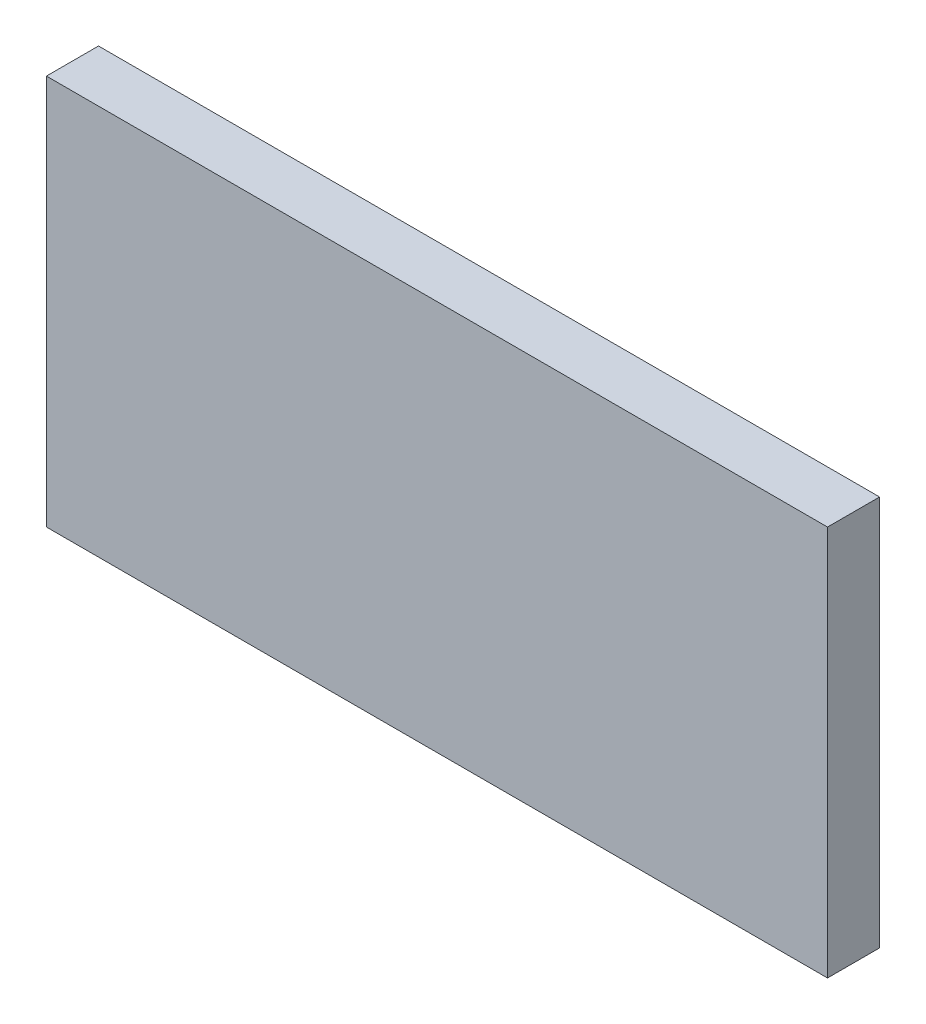
ISO-10303-21;
HEADER;
FILE_DESCRIPTION(('STEP AP214'),'2;1');
FILE_NAME('part.step','',(''),(''),'','','');
FILE_SCHEMA(('AUTOMOTIVE_DESIGN { 1 0 10303 214 1 1 1 1 }'));
ENDSEC;
DATA;
#1=APPLICATION_CONTEXT('core data for automotive mechanical design processes');
#2=APPLICATION_PROTOCOL_DEFINITION('international standard','automotive_design',2000,#1);
#3=PRODUCT_CONTEXT('',#1,'mechanical');
#4=PRODUCT('Part','Part','',(#3));
#5=PRODUCT_RELATED_PRODUCT_CATEGORY('part','',(#4));
#6=PRODUCT_DEFINITION_FORMATION('','',#4);
#7=PRODUCT_DEFINITION_CONTEXT('part definition',#1,'design');
#8=PRODUCT_DEFINITION('design','',#6,#7);
#9=PRODUCT_DEFINITION_SHAPE('','',#8);
#10=(LENGTH_UNIT() NAMED_UNIT(*) SI_UNIT(.MILLI.,.METRE.));
#11=(NAMED_UNIT(*) PLANE_ANGLE_UNIT() SI_UNIT($,.RADIAN.));
#12=(NAMED_UNIT(*) SI_UNIT($,.STERADIAN.) SOLID_ANGLE_UNIT());
#13=UNCERTAINTY_MEASURE_WITH_UNIT(LENGTH_MEASURE(1.E-05),#10,'distance_accuracy_value','');
#14=(GEOMETRIC_REPRESENTATION_CONTEXT(3) GLOBAL_UNCERTAINTY_ASSIGNED_CONTEXT((#13)) GLOBAL_UNIT_ASSIGNED_CONTEXT((#10,
#11,#12)) REPRESENTATION_CONTEXT('',''));
#15=CARTESIAN_POINT('',(0.,0.,0.));
#16=DIRECTION('',(0.,0.,1.));
#17=DIRECTION('',(1.,0.,0.));
#18=AXIS2_PLACEMENT_3D('',#15,#16,#17);
#19=CARTESIAN_POINT('',(-150.,-75.,20.));
#20=DIRECTION('',(1.,0.,0.));
#21=DIRECTION('',(0.,0.,-1.));
#22=AXIS2_PLACEMENT_3D('',#19,#20,#21);
#23=PLANE('',#22);
#24=DIRECTION('',(0.,-1.,0.));
#25=VECTOR('',#24,1.);
#26=CARTESIAN_POINT('',(-150.,-75.,0.));
#27=LINE('',#26,#25);
#28=CARTESIAN_POINT('',(-150.,75.,0.));
#29=VERTEX_POINT('',#28);
#30=CARTESIAN_POINT('',(-150.,-75.,0.));
#31=VERTEX_POINT('',#30);
#32=EDGE_CURVE('E188',#29,#31,#27,.T.);
#33=ORIENTED_EDGE('',*,*,#32,.T.);
#34=DIRECTION('',(0.,0.,-1.));
#35=VECTOR('',#34,1.);
#36=CARTESIAN_POINT('',(-150.,-75.,20.));
#37=LINE('',#36,#35);
#38=CARTESIAN_POINT('',(-150.,-75.,20.));
#39=VERTEX_POINT('',#38);
#40=EDGE_CURVE('E11',#39,#31,#37,.T.);
#41=ORIENTED_EDGE('',*,*,#40,.F.);
#42=DIRECTION('',(0.,-1.,0.));
#43=VECTOR('',#42,1.);
#44=CARTESIAN_POINT('',(-150.,-75.,20.));
#45=LINE('',#44,#43);
#46=CARTESIAN_POINT('',(-150.,75.,20.));
#47=VERTEX_POINT('',#46);
#48=EDGE_CURVE('E195',#47,#39,#45,.T.);
#49=ORIENTED_EDGE('',*,*,#48,.F.);
#50=DIRECTION('',(0.,0.,-1.));
#51=VECTOR('',#50,1.);
#52=CARTESIAN_POINT('',(-150.,75.,20.));
#53=LINE('',#52,#51);
#54=EDGE_CURVE('E205',#47,#29,#53,.T.);
#55=ORIENTED_EDGE('',*,*,#54,.T.);
#56=EDGE_LOOP('',(#33,#41,#49,#55));
#57=FACE_BOUND('',#56,.T.);
#58=ADVANCED_FACE('F36',(#57),#23,.F.);
#59=CARTESIAN_POINT('',(150.,-75.,20.));
#60=DIRECTION('',(0.,1.,0.));
#61=DIRECTION('',(-1.,0.,0.));
#62=AXIS2_PLACEMENT_3D('',#59,#60,#61);
#63=PLANE('',#62);
#64=DIRECTION('',(1.,0.,0.));
#65=VECTOR('',#64,1.);
#66=CARTESIAN_POINT('',(150.,-75.,0.));
#67=LINE('',#66,#65);
#68=CARTESIAN_POINT('',(150.,-75.,0.));
#69=VERTEX_POINT('',#68);
#70=EDGE_CURVE('E208',#31,#69,#67,.T.);
#71=ORIENTED_EDGE('',*,*,#70,.T.);
#72=DIRECTION('',(0.,0.,-1.));
#73=VECTOR('',#72,1.);
#74=CARTESIAN_POINT('',(150.,-75.,20.));
#75=LINE('',#74,#73);
#76=CARTESIAN_POINT('',(150.,-75.,20.));
#77=VERTEX_POINT('',#76);
#78=EDGE_CURVE('E43',#77,#69,#75,.T.);
#79=ORIENTED_EDGE('',*,*,#78,.F.);
#80=DIRECTION('',(1.,0.,0.));
#81=VECTOR('',#80,1.);
#82=CARTESIAN_POINT('',(150.,-75.,20.));
#83=LINE('',#82,#81);
#84=EDGE_CURVE('E198',#39,#77,#83,.T.);
#85=ORIENTED_EDGE('',*,*,#84,.F.);
#86=ORIENTED_EDGE('',*,*,#40,.T.);
#87=EDGE_LOOP('',(#71,#79,#85,#86));
#88=FACE_BOUND('',#87,.T.);
#89=ADVANCED_FACE('F238',(#88),#63,.F.);
#90=CARTESIAN_POINT('',(150.,-75.,20.));
#91=DIRECTION('',(-1.,0.,0.));
#92=DIRECTION('',(0.,0.,1.));
#93=AXIS2_PLACEMENT_3D('',#90,#91,#92);
#94=PLANE('',#93);
#95=DIRECTION('',(0.,1.,0.));
#96=VECTOR('',#95,1.);
#97=CARTESIAN_POINT('',(150.,-75.,0.));
#98=LINE('',#97,#96);
#99=CARTESIAN_POINT('',(150.,75.,0.));
#100=VERTEX_POINT('',#99);
#101=EDGE_CURVE('E210',#69,#100,#98,.T.);
#102=ORIENTED_EDGE('',*,*,#101,.T.);
#103=DIRECTION('',(0.,0.,-1.));
#104=VECTOR('',#103,1.);
#105=CARTESIAN_POINT('',(150.,75.,20.));
#106=LINE('',#105,#104);
#107=CARTESIAN_POINT('',(150.,75.,20.));
#108=VERTEX_POINT('',#107);
#109=EDGE_CURVE('E215',#108,#100,#106,.T.);
#110=ORIENTED_EDGE('',*,*,#109,.F.);
#111=DIRECTION('',(0.,1.,0.));
#112=VECTOR('',#111,1.);
#113=CARTESIAN_POINT('',(150.,-75.,20.));
#114=LINE('',#113,#112);
#115=EDGE_CURVE('E201',#77,#108,#114,.T.);
#116=ORIENTED_EDGE('',*,*,#115,.F.);
#117=ORIENTED_EDGE('',*,*,#78,.T.);
#118=EDGE_LOOP('',(#102,#110,#116,#117));
#119=FACE_BOUND('',#118,.T.);
#120=ADVANCED_FACE('F222',(#119),#94,.F.);
#121=CARTESIAN_POINT('',(150.,75.,20.));
#122=DIRECTION('',(0.,-1.,0.));
#123=DIRECTION('',(1.,0.,0.));
#124=AXIS2_PLACEMENT_3D('',#121,#122,#123);
#125=PLANE('',#124);
#126=DIRECTION('',(-1.,0.,0.));
#127=VECTOR('',#126,1.);
#128=CARTESIAN_POINT('',(150.,75.,0.));
#129=LINE('',#128,#127);
#130=EDGE_CURVE('E199',#100,#29,#129,.T.);
#131=ORIENTED_EDGE('',*,*,#130,.T.);
#132=ORIENTED_EDGE('',*,*,#54,.F.);
#133=DIRECTION('',(-1.,0.,0.));
#134=VECTOR('',#133,1.);
#135=CARTESIAN_POINT('',(150.,75.,20.));
#136=LINE('',#135,#134);
#137=EDGE_CURVE('E203',#108,#47,#136,.T.);
#138=ORIENTED_EDGE('',*,*,#137,.F.);
#139=ORIENTED_EDGE('',*,*,#109,.T.);
#140=EDGE_LOOP('',(#131,#132,#138,#139));
#141=FACE_BOUND('',#140,.T.);
#142=ADVANCED_FACE('F231',(#141),#125,.F.);
#143=CARTESIAN_POINT('',(0.,0.,20.));
#144=DIRECTION('',(0.,0.,1.));
#145=DIRECTION('',(1.,0.,0.));
#146=AXIS2_PLACEMENT_3D('',#143,#144,#145);
#147=PLANE('',#146);
#148=ORIENTED_EDGE('',*,*,#48,.T.);
#149=ORIENTED_EDGE('',*,*,#84,.T.);
#150=ORIENTED_EDGE('',*,*,#115,.T.);
#151=ORIENTED_EDGE('',*,*,#137,.T.);
#152=EDGE_LOOP('',(#148,#149,#150,#151));
#153=FACE_BOUND('',#152,.T.);
#154=ADVANCED_FACE('F237',(#153),#147,.T.);
#155=CARTESIAN_POINT('',(0.,0.,0.));
#156=DIRECTION('',(0.,0.,1.));
#157=DIRECTION('',(1.,0.,0.));
#158=AXIS2_PLACEMENT_3D('',#155,#156,#157);
#159=PLANE('',#158);
#160=DIRECTION('',(0.,1.,0.));
#161=VECTOR('',#160,1.);
#162=CARTESIAN_POINT('',(56.38,10.,0.));
#163=LINE('',#162,#161);
#164=CARTESIAN_POINT('',(56.38,10.,0.));
#165=VERTEX_POINT('',#164);
#166=CARTESIAN_POINT('',(56.38,30.,0.));
#167=VERTEX_POINT('',#166);
#168=EDGE_CURVE('E50',#165,#167,#163,.T.);
#169=ORIENTED_EDGE('',*,*,#168,.F.);
#170=DIRECTION('',(1.,0.,0.));
#171=VECTOR('',#170,1.);
#172=CARTESIAN_POINT('',(96.3800000000001,10.,0.));
#173=LINE('',#172,#171);
#174=CARTESIAN_POINT('',(96.3800000000001,10.,0.));
#175=VERTEX_POINT('',#174);
#176=EDGE_CURVE('E54',#165,#175,#173,.T.);
#177=ORIENTED_EDGE('',*,*,#176,.T.);
#178=DIRECTION('',(0.,1.,0.));
#179=VECTOR('',#178,1.);
#180=CARTESIAN_POINT('',(96.3800000000001,10.,0.));
#181=LINE('',#180,#179);
#182=CARTESIAN_POINT('',(96.3800000000001,30.,0.));
#183=VERTEX_POINT('',#182);
#184=EDGE_CURVE('E134',#175,#183,#181,.T.);
#185=ORIENTED_EDGE('',*,*,#184,.T.);
#186=DIRECTION('',(1.,0.,0.));
#187=VECTOR('',#186,1.);
#188=CARTESIAN_POINT('',(96.3800000000001,30.,0.));
#189=LINE('',#188,#187);
#190=EDGE_CURVE('E150',#167,#183,#189,.T.);
#191=ORIENTED_EDGE('',*,*,#190,.F.);
#192=EDGE_LOOP('',(#169,#177,#185,#191));
#193=FACE_BOUND('',#192,.T.);
#194=DIRECTION('',(-1.,0.,0.));
#195=VECTOR('',#194,1.);
#196=CARTESIAN_POINT('',(-90.25,-15.,0.));
#197=LINE('',#196,#195);
#198=CARTESIAN_POINT('',(-9.99999999999995,-15.,0.));
#199=VERTEX_POINT('',#198);
#200=CARTESIAN_POINT('',(-90.25,-15.,0.));
#201=VERTEX_POINT('',#200);
#202=EDGE_CURVE('E178',#199,#201,#197,.T.);
#203=ORIENTED_EDGE('',*,*,#202,.F.);
#204=DIRECTION('',(0.,-1.,0.));
#205=VECTOR('',#204,1.);
#206=CARTESIAN_POINT('',(-9.99999999999995,-15.,0.));
#207=LINE('',#206,#205);
#208=CARTESIAN_POINT('',(-9.99999999999996,15.,0.));
#209=VERTEX_POINT('',#208);
#210=EDGE_CURVE('E160',#209,#199,#207,.T.);
#211=ORIENTED_EDGE('',*,*,#210,.F.);
#212=DIRECTION('',(1.,0.,0.));
#213=VECTOR('',#212,1.);
#214=CARTESIAN_POINT('',(-90.25,15.,0.));
#215=LINE('',#214,#213);
#216=CARTESIAN_POINT('',(-90.25,15.,0.));
#217=VERTEX_POINT('',#216);
#218=EDGE_CURVE('E167',#217,#209,#215,.T.);
#219=ORIENTED_EDGE('',*,*,#218,.F.);
#220=DIRECTION('',(0.,1.,0.));
#221=VECTOR('',#220,1.);
#222=CARTESIAN_POINT('',(-90.25,-15.,0.));
#223=LINE('',#222,#221);
#224=EDGE_CURVE('E181',#201,#217,#223,.T.);
#225=ORIENTED_EDGE('',*,*,#224,.F.);
#226=EDGE_LOOP('',(#203,#211,#219,#225));
#227=FACE_BOUND('',#226,.T.);
#228=ORIENTED_EDGE('',*,*,#32,.F.);
#229=ORIENTED_EDGE('',*,*,#130,.F.);
#230=ORIENTED_EDGE('',*,*,#101,.F.);
#231=ORIENTED_EDGE('',*,*,#70,.F.);
#232=EDGE_LOOP('',(#228,#229,#230,#231));
#233=FACE_BOUND('',#232,.T.);
#234=ADVANCED_FACE('F228',(#193,#227,#233),#159,.F.);
#235=CARTESIAN_POINT('',(-9.99999999999995,-15.,15.));
#236=DIRECTION('',(1.,0.,0.));
#237=DIRECTION('',(0.,1.,0.));
#238=AXIS2_PLACEMENT_3D('',#235,#236,#237);
#239=PLANE('',#238);
#240=ORIENTED_EDGE('',*,*,#210,.T.);
#241=DIRECTION('',(0.,0.,-1.));
#242=VECTOR('',#241,1.);
#243=CARTESIAN_POINT('',(-9.99999999999995,-15.,15.));
#244=LINE('',#243,#242);
#245=CARTESIAN_POINT('',(-9.99999999999995,-15.,15.));
#246=VERTEX_POINT('',#245);
#247=EDGE_CURVE('E176',#246,#199,#244,.T.);
#248=ORIENTED_EDGE('',*,*,#247,.F.);
#249=DIRECTION('',(0.,-1.,0.));
#250=VECTOR('',#249,1.);
#251=CARTESIAN_POINT('',(-9.99999999999995,-15.,15.));
#252=LINE('',#251,#250);
#253=CARTESIAN_POINT('',(-9.99999999999996,15.,15.));
#254=VERTEX_POINT('',#253);
#255=EDGE_CURVE('E163',#254,#246,#252,.T.);
#256=ORIENTED_EDGE('',*,*,#255,.F.);
#257=DIRECTION('',(0.,0.,-1.));
#258=VECTOR('',#257,1.);
#259=CARTESIAN_POINT('',(-9.99999999999996,15.,15.));
#260=LINE('',#259,#258);
#261=EDGE_CURVE('E186',#254,#209,#260,.T.);
#262=ORIENTED_EDGE('',*,*,#261,.T.);
#263=EDGE_LOOP('',(#240,#248,#256,#262));
#264=FACE_BOUND('',#263,.T.);
#265=ADVANCED_FACE('F250',(#264),#239,.F.);
#266=CARTESIAN_POINT('',(-90.25,15.,15.));
#267=DIRECTION('',(0.,1.,0.));
#268=DIRECTION('',(-1.,0.,0.));
#269=AXIS2_PLACEMENT_3D('',#266,#267,#268);
#270=PLANE('',#269);
#271=ORIENTED_EDGE('',*,*,#218,.T.);
#272=ORIENTED_EDGE('',*,*,#261,.F.);
#273=DIRECTION('',(1.,0.,0.));
#274=VECTOR('',#273,1.);
#275=CARTESIAN_POINT('',(-90.25,15.,15.));
#276=LINE('',#275,#274);
#277=CARTESIAN_POINT('',(-90.25,15.,15.));
#278=VERTEX_POINT('',#277);
#279=EDGE_CURVE('E173',#278,#254,#276,.T.);
#280=ORIENTED_EDGE('',*,*,#279,.F.);
#281=DIRECTION('',(0.,0.,-1.));
#282=VECTOR('',#281,1.);
#283=CARTESIAN_POINT('',(-90.25,15.,15.));
#284=LINE('',#283,#282);
#285=EDGE_CURVE('E189',#278,#217,#284,.T.);
#286=ORIENTED_EDGE('',*,*,#285,.T.);
#287=EDGE_LOOP('',(#271,#272,#280,#286));
#288=FACE_BOUND('',#287,.T.);
#289=ADVANCED_FACE('F255',(#288),#270,.F.);
#290=CARTESIAN_POINT('',(-90.25,-15.,15.));
#291=DIRECTION('',(-1.,0.,0.));
#292=DIRECTION('',(0.,0.,1.));
#293=AXIS2_PLACEMENT_3D('',#290,#291,#292);
#294=PLANE('',#293);
#295=ORIENTED_EDGE('',*,*,#224,.T.);
#296=ORIENTED_EDGE('',*,*,#285,.F.);
#297=DIRECTION('',(0.,1.,0.));
#298=VECTOR('',#297,1.);
#299=CARTESIAN_POINT('',(-90.25,-15.,15.));
#300=LINE('',#299,#298);
#301=CARTESIAN_POINT('',(-90.25,-15.,15.));
#302=VERTEX_POINT('',#301);
#303=EDGE_CURVE('E170',#302,#278,#300,.T.);
#304=ORIENTED_EDGE('',*,*,#303,.F.);
#305=DIRECTION('',(0.,0.,-1.));
#306=VECTOR('',#305,1.);
#307=CARTESIAN_POINT('',(-90.25,-15.,15.));
#308=LINE('',#307,#306);
#309=EDGE_CURVE('E191',#302,#201,#308,.T.);
#310=ORIENTED_EDGE('',*,*,#309,.T.);
#311=EDGE_LOOP('',(#295,#296,#304,#310));
#312=FACE_BOUND('',#311,.T.);
#313=ADVANCED_FACE('F261',(#312),#294,.F.);
#314=CARTESIAN_POINT('',(-90.25,-15.,15.));
#315=DIRECTION('',(0.,-1.,0.));
#316=DIRECTION('',(1.,0.,0.));
#317=AXIS2_PLACEMENT_3D('',#314,#315,#316);
#318=PLANE('',#317);
#319=ORIENTED_EDGE('',*,*,#202,.T.);
#320=ORIENTED_EDGE('',*,*,#309,.F.);
#321=DIRECTION('',(-1.,0.,0.));
#322=VECTOR('',#321,1.);
#323=CARTESIAN_POINT('',(-90.25,-15.,15.));
#324=LINE('',#323,#322);
#325=EDGE_CURVE('E166',#246,#302,#324,.T.);
#326=ORIENTED_EDGE('',*,*,#325,.F.);
#327=ORIENTED_EDGE('',*,*,#247,.T.);
#328=EDGE_LOOP('',(#319,#320,#326,#327));
#329=FACE_BOUND('',#328,.T.);
#330=ADVANCED_FACE('F257',(#329),#318,.F.);
#331=CARTESIAN_POINT('',(0.,0.,15.));
#332=DIRECTION('',(0.,0.,-1.));
#333=DIRECTION('',(-1.,0.,0.));
#334=AXIS2_PLACEMENT_3D('',#331,#332,#333);
#335=PLANE('',#334);
#336=ORIENTED_EDGE('',*,*,#255,.T.);
#337=ORIENTED_EDGE('',*,*,#325,.T.);
#338=ORIENTED_EDGE('',*,*,#303,.T.);
#339=ORIENTED_EDGE('',*,*,#279,.T.);
#340=EDGE_LOOP('',(#336,#337,#338,#339));
#341=FACE_BOUND('',#340,.T.);
#342=ADVANCED_FACE('F260',(#341),#335,.T.);
#343=CARTESIAN_POINT('',(56.38,10.,0.));
#344=DIRECTION('',(-1.,0.,0.));
#345=DIRECTION('',(0.,0.,1.));
#346=AXIS2_PLACEMENT_3D('',#343,#344,#345);
#347=PLANE('',#346);
#348=DIRECTION('',(0.,0.,1.));
#349=VECTOR('',#348,1.);
#350=CARTESIAN_POINT('',(56.38,30.,0.));
#351=LINE('',#350,#349);
#352=CARTESIAN_POINT('',(56.38,30.,-12.86));
#353=VERTEX_POINT('',#352);
#354=EDGE_CURVE('E145',#353,#167,#351,.T.);
#355=ORIENTED_EDGE('',*,*,#354,.F.);
#356=DIRECTION('',(0.,1.,0.));
#357=VECTOR('',#356,1.);
#358=CARTESIAN_POINT('',(56.38,10.,-12.86));
#359=LINE('',#358,#357);
#360=CARTESIAN_POINT('',(56.38,10.,-12.86));
#361=VERTEX_POINT('',#360);
#362=EDGE_CURVE('E133',#361,#353,#359,.T.);
#363=ORIENTED_EDGE('',*,*,#362,.F.);
#364=DIRECTION('',(0.,0.,1.));
#365=VECTOR('',#364,1.);
#366=CARTESIAN_POINT('',(56.38,10.,0.));
#367=LINE('',#366,#365);
#368=EDGE_CURVE('E141',#361,#165,#367,.T.);
#369=ORIENTED_EDGE('',*,*,#368,.T.);
#370=ORIENTED_EDGE('',*,*,#168,.T.);
#371=EDGE_LOOP('',(#355,#363,#369,#370));
#372=FACE_BOUND('',#371,.T.);
#373=ADVANCED_FACE('F271',(#372),#347,.T.);
#374=CARTESIAN_POINT('',(76.38,10.,-12.86));
#375=DIRECTION('',(0.,1.,0.));
#376=DIRECTION('',(0.,0.,1.));
#377=AXIS2_PLACEMENT_3D('',#374,#375,#376);
#378=CYLINDRICAL_SURFACE('',#377,20.);
#379=CARTESIAN_POINT('',(76.38,30.,-12.86));
#380=DIRECTION('',(0.,1.,0.));
#381=DIRECTION('',(0.,0.,-1.));
#382=AXIS2_PLACEMENT_3D('',#379,#380,#381);
#383=CIRCLE('',#382,20.);
#384=CARTESIAN_POINT('',(96.3800000000001,30.,-12.86));
#385=VERTEX_POINT('',#384);
#386=EDGE_CURVE('E128',#385,#353,#383,.T.);
#387=ORIENTED_EDGE('',*,*,#386,.F.);
#388=DIRECTION('',(0.,1.,0.));
#389=VECTOR('',#388,1.);
#390=CARTESIAN_POINT('',(96.3800000000001,10.,-12.86));
#391=LINE('',#390,#389);
#392=CARTESIAN_POINT('',(96.3800000000001,10.,-12.86));
#393=VERTEX_POINT('',#392);
#394=EDGE_CURVE('E122',#393,#385,#391,.T.);
#395=ORIENTED_EDGE('',*,*,#394,.F.);
#396=CARTESIAN_POINT('',(76.38,10.,-12.86));
#397=DIRECTION('',(0.,1.,0.));
#398=DIRECTION('',(0.,0.,-1.));
#399=AXIS2_PLACEMENT_3D('',#396,#397,#398);
#400=CIRCLE('',#399,20.);
#401=EDGE_CURVE('E125',#393,#361,#400,.T.);
#402=ORIENTED_EDGE('',*,*,#401,.T.);
#403=ORIENTED_EDGE('',*,*,#362,.T.);
#404=EDGE_LOOP('',(#387,#395,#402,#403));
#405=FACE_BOUND('',#404,.T.);
#406=ADVANCED_FACE('F124',(#405),#378,.T.);
#407=CARTESIAN_POINT('',(96.3800000000001,10.,-12.86));
#408=DIRECTION('',(1.,0.,0.));
#409=DIRECTION('',(0.,0.,-1.));
#410=AXIS2_PLACEMENT_3D('',#407,#408,#409);
#411=PLANE('',#410);
#412=DIRECTION('',(0.,0.,-1.));
#413=VECTOR('',#412,1.);
#414=CARTESIAN_POINT('',(96.3800000000001,30.,-12.86));
#415=LINE('',#414,#413);
#416=EDGE_CURVE('E153',#183,#385,#415,.T.);
#417=ORIENTED_EDGE('',*,*,#416,.F.);
#418=ORIENTED_EDGE('',*,*,#184,.F.);
#419=DIRECTION('',(0.,0.,-1.));
#420=VECTOR('',#419,1.);
#421=CARTESIAN_POINT('',(96.3800000000001,10.,-12.86));
#422=LINE('',#421,#420);
#423=EDGE_CURVE('E139',#175,#393,#422,.T.);
#424=ORIENTED_EDGE('',*,*,#423,.T.);
#425=ORIENTED_EDGE('',*,*,#394,.T.);
#426=EDGE_LOOP('',(#417,#418,#424,#425));
#427=FACE_BOUND('',#426,.T.);
#428=ADVANCED_FACE('F143',(#427),#411,.T.);
#429=CARTESIAN_POINT('',(76.38,10.,-12.86));
#430=DIRECTION('',(0.,-1.,0.));
#431=DIRECTION('',(0.,0.,-1.));
#432=AXIS2_PLACEMENT_3D('',#429,#430,#431);
#433=PLANE('',#432);
#434=CARTESIAN_POINT('',(76.38,10.,-12.86));
#435=DIRECTION('',(0.,1.,0.));
#436=DIRECTION('',(0.,0.,1.));
#437=AXIS2_PLACEMENT_3D('',#434,#435,#436);
#438=CIRCLE('',#437,9.99999999999999);
#439=CARTESIAN_POINT('',(76.38,10.,-2.86000000000001));
#440=VERTEX_POINT('',#439);
#441=EDGE_CURVE('E154',#440,#440,#438,.T.);
#442=ORIENTED_EDGE('',*,*,#441,.T.);
#443=EDGE_LOOP('',(#442));
#444=FACE_BOUND('',#443,.T.);
#445=ORIENTED_EDGE('',*,*,#176,.F.);
#446=ORIENTED_EDGE('',*,*,#368,.F.);
#447=ORIENTED_EDGE('',*,*,#401,.F.);
#448=ORIENTED_EDGE('',*,*,#423,.F.);
#449=EDGE_LOOP('',(#445,#446,#447,#448));
#450=FACE_BOUND('',#449,.T.);
#451=ADVANCED_FACE('F138',(#444,#450),#433,.T.);
#452=CARTESIAN_POINT('',(76.38,30.,-12.86));
#453=DIRECTION('',(0.,-1.,0.));
#454=DIRECTION('',(0.,0.,-1.));
#455=AXIS2_PLACEMENT_3D('',#452,#453,#454);
#456=PLANE('',#455);
#457=CARTESIAN_POINT('',(76.38,30.,-12.86));
#458=DIRECTION('',(0.,1.,0.));
#459=DIRECTION('',(0.,0.,1.));
#460=AXIS2_PLACEMENT_3D('',#457,#458,#459);
#461=CIRCLE('',#460,9.99999999999999);
#462=CARTESIAN_POINT('',(76.38,30.,-2.86000000000001));
#463=VERTEX_POINT('',#462);
#464=EDGE_CURVE('E297',#463,#463,#461,.T.);
#465=ORIENTED_EDGE('',*,*,#464,.F.);
#466=EDGE_LOOP('',(#465));
#467=FACE_BOUND('',#466,.T.);
#468=ORIENTED_EDGE('',*,*,#190,.T.);
#469=ORIENTED_EDGE('',*,*,#416,.T.);
#470=ORIENTED_EDGE('',*,*,#386,.T.);
#471=ORIENTED_EDGE('',*,*,#354,.T.);
#472=EDGE_LOOP('',(#468,#469,#470,#471));
#473=FACE_BOUND('',#472,.T.);
#474=ADVANCED_FACE('F280',(#467,#473),#456,.F.);
#475=CARTESIAN_POINT('',(76.38,10.,-12.86));
#476=DIRECTION('',(0.,1.,0.));
#477=DIRECTION('',(0.,0.,1.));
#478=AXIS2_PLACEMENT_3D('',#475,#476,#477);
#479=CYLINDRICAL_SURFACE('',#478,9.99999999999999);
#480=ORIENTED_EDGE('',*,*,#441,.F.);
#481=EDGE_LOOP('',(#480));
#482=FACE_BOUND('',#481,.T.);
#483=ORIENTED_EDGE('',*,*,#464,.T.);
#484=EDGE_LOOP('',(#483));
#485=FACE_BOUND('',#484,.T.);
#486=ADVANCED_FACE('F283',(#482,#485),#479,.F.);
#487=CLOSED_SHELL('',(#58,#89,#120,#142,#154,#234,#265,#289,#313,#330,#342,#373,#406,#428,#451,
#474,#486));
#488=MANIFOLD_SOLID_BREP('B2',#487);
#489=ADVANCED_BREP_SHAPE_REPRESENTATION('',(#18,#488),#14);
#490=SHAPE_DEFINITION_REPRESENTATION(#9,#489);
ENDSEC;
END-ISO-10303-21;
